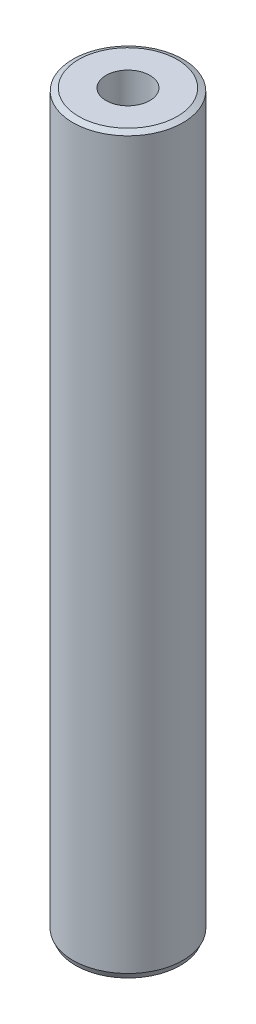
ISO-10303-21;
HEADER;
FILE_DESCRIPTION(('STEP AP214'),'2;1');
FILE_NAME('part.step','',(''),(''),'','','');
FILE_SCHEMA(('AUTOMOTIVE_DESIGN { 1 0 10303 214 1 1 1 1 }'));
ENDSEC;
DATA;
#1=APPLICATION_CONTEXT('core data for automotive mechanical design processes');
#2=APPLICATION_PROTOCOL_DEFINITION('international standard','automotive_design',2000,#1);
#3=PRODUCT_CONTEXT('',#1,'mechanical');
#4=PRODUCT('Part','Part','',(#3));
#5=PRODUCT_RELATED_PRODUCT_CATEGORY('part','',(#4));
#6=PRODUCT_DEFINITION_FORMATION('','',#4);
#7=PRODUCT_DEFINITION_CONTEXT('part definition',#1,'design');
#8=PRODUCT_DEFINITION('design','',#6,#7);
#9=PRODUCT_DEFINITION_SHAPE('','',#8);
#10=(LENGTH_UNIT() NAMED_UNIT(*) SI_UNIT(.MILLI.,.METRE.));
#11=(NAMED_UNIT(*) PLANE_ANGLE_UNIT() SI_UNIT($,.RADIAN.));
#12=(NAMED_UNIT(*) SI_UNIT($,.STERADIAN.) SOLID_ANGLE_UNIT());
#13=UNCERTAINTY_MEASURE_WITH_UNIT(LENGTH_MEASURE(1.E-05),#10,'distance_accuracy_value','');
#14=(GEOMETRIC_REPRESENTATION_CONTEXT(3) GLOBAL_UNCERTAINTY_ASSIGNED_CONTEXT((#13)) GLOBAL_UNIT_ASSIGNED_CONTEXT((#10,
#11,#12)) REPRESENTATION_CONTEXT('',''));
#15=CARTESIAN_POINT('',(0.,0.,0.));
#16=DIRECTION('',(0.,0.,1.));
#17=DIRECTION('',(1.,0.,0.));
#18=AXIS2_PLACEMENT_3D('',#15,#16,#17);
#19=CARTESIAN_POINT('',(0.,600.,0.));
#20=DIRECTION('',(0.,-1.,0.));
#21=DIRECTION('',(0.,0.,-1.));
#22=AXIS2_PLACEMENT_3D('',#19,#20,#21);
#23=CYLINDRICAL_SURFACE('',#22,45.);
#24=CARTESIAN_POINT('',(0.,597.894981040464,0.));
#25=DIRECTION('',(0.,1.,0.));
#26=DIRECTION('',(0.,0.,1.));
#27=AXIS2_PLACEMENT_3D('',#24,#25,#26);
#28=CIRCLE('',#27,45.);
#29=CARTESIAN_POINT('',(0.,597.894981040464,45.));
#30=VERTEX_POINT('',#29);
#31=EDGE_CURVE('E50',#30,#30,#28,.F.);
#32=ORIENTED_EDGE('',*,*,#31,.T.);
#33=EDGE_LOOP('',(#32));
#34=FACE_BOUND('',#33,.T.);
#35=CARTESIAN_POINT('',(0.,4.68177161671279,0.));
#36=DIRECTION('',(0.,1.,0.));
#37=DIRECTION('',(0.,0.,1.));
#38=AXIS2_PLACEMENT_3D('',#35,#36,#37);
#39=CIRCLE('',#38,45.);
#40=CARTESIAN_POINT('',(0.,4.68177161671279,45.));
#41=VERTEX_POINT('',#40);
#42=EDGE_CURVE('E51',#41,#41,#39,.T.);
#43=ORIENTED_EDGE('',*,*,#42,.T.);
#44=EDGE_LOOP('',(#43));
#45=FACE_BOUND('',#44,.T.);
#46=ADVANCED_FACE('F39',(#34,#45),#23,.T.);
#47=CARTESIAN_POINT('',(0.,600.,0.));
#48=DIRECTION('',(0.,1.,0.));
#49=DIRECTION('',(0.,0.,1.));
#50=AXIS2_PLACEMENT_3D('',#47,#48,#49);
#51=PLANE('',#50);
#52=CARTESIAN_POINT('',(0.,600.,0.));
#53=DIRECTION('',(0.,1.,0.));
#54=DIRECTION('',(0.,0.,1.));
#55=AXIS2_PLACEMENT_3D('',#52,#53,#54);
#56=CIRCLE('',#55,40.3182283832877);
#57=CARTESIAN_POINT('',(0.,600.,40.3182283832877));
#58=VERTEX_POINT('',#57);
#59=EDGE_CURVE('E54',#58,#58,#56,.T.);
#60=ORIENTED_EDGE('',*,*,#59,.T.);
#61=EDGE_LOOP('',(#60));
#62=FACE_BOUND('',#61,.T.);
#63=CARTESIAN_POINT('',(0.,600.,0.));
#64=DIRECTION('',(0.,1.,0.));
#65=DIRECTION('',(0.,0.,1.));
#66=AXIS2_PLACEMENT_3D('',#63,#64,#65);
#67=CIRCLE('',#66,17.9281260531012);
#68=CARTESIAN_POINT('',(0.,600.,17.9281260531012));
#69=VERTEX_POINT('',#68);
#70=EDGE_CURVE('E58',#69,#69,#67,.T.);
#71=ORIENTED_EDGE('',*,*,#70,.F.);
#72=EDGE_LOOP('',(#71));
#73=FACE_BOUND('',#72,.T.);
#74=ADVANCED_FACE('F69',(#62,#73),#51,.T.);
#75=CARTESIAN_POINT('',(0.,0.,0.));
#76=DIRECTION('',(0.,1.,0.));
#77=DIRECTION('',(0.,0.,1.));
#78=AXIS2_PLACEMENT_3D('',#75,#76,#77);
#79=PLANE('',#78);
#80=CARTESIAN_POINT('',(0.,0.,0.));
#81=DIRECTION('',(0.,1.,0.));
#82=DIRECTION('',(0.,0.,1.));
#83=AXIS2_PLACEMENT_3D('',#80,#81,#82);
#84=CIRCLE('',#83,42.8949810404639);
#85=CARTESIAN_POINT('',(0.,0.,42.8949810404639));
#86=VERTEX_POINT('',#85);
#87=EDGE_CURVE('E10',#86,#86,#84,.F.);
#88=ORIENTED_EDGE('',*,*,#87,.T.);
#89=EDGE_LOOP('',(#88));
#90=FACE_BOUND('',#89,.T.);
#91=CARTESIAN_POINT('',(0.,0.,0.));
#92=DIRECTION('',(0.,1.,0.));
#93=DIRECTION('',(0.,0.,1.));
#94=AXIS2_PLACEMENT_3D('',#91,#92,#93);
#95=CIRCLE('',#94,17.9281260531012);
#96=CARTESIAN_POINT('',(0.,0.,17.9281260531012));
#97=VERTEX_POINT('',#96);
#98=EDGE_CURVE('E63',#97,#97,#95,.T.);
#99=ORIENTED_EDGE('',*,*,#98,.T.);
#100=EDGE_LOOP('',(#99));
#101=FACE_BOUND('',#100,.T.);
#102=ADVANCED_FACE('F75',(#90,#101),#79,.F.);
#103=CARTESIAN_POINT('',(0.,600.,0.));
#104=DIRECTION('',(0.,-1.,0.));
#105=DIRECTION('',(0.,0.,-1.));
#106=AXIS2_PLACEMENT_3D('',#103,#104,#105);
#107=CYLINDRICAL_SURFACE('',#106,17.9281260531012);
#108=ORIENTED_EDGE('',*,*,#70,.T.);
#109=EDGE_LOOP('',(#108));
#110=FACE_BOUND('',#109,.T.);
#111=ORIENTED_EDGE('',*,*,#98,.F.);
#112=EDGE_LOOP('',(#111));
#113=FACE_BOUND('',#112,.T.);
#114=ADVANCED_FACE('F70',(#110,#113),#107,.F.);
#115=CARTESIAN_POINT('',(0.,600.,0.));
#116=DIRECTION('',(0.,-1.,0.));
#117=DIRECTION('',(0.,0.,-1.));
#118=AXIS2_PLACEMENT_3D('',#115,#116,#117);
#119=CONICAL_SURFACE('',#118,40.3182283832877,1.14825831084162);
#120=ORIENTED_EDGE('',*,*,#31,.F.);
#121=EDGE_LOOP('',(#120));
#122=FACE_BOUND('',#121,.T.);
#123=ORIENTED_EDGE('',*,*,#59,.F.);
#124=EDGE_LOOP('',(#123));
#125=FACE_BOUND('',#124,.T.);
#126=ADVANCED_FACE('F81',(#122,#125),#119,.T.);
#127=CARTESIAN_POINT('',(0.,4.68177161671279,0.));
#128=DIRECTION('',(0.,1.,0.));
#129=DIRECTION('',(0.,0.,1.));
#130=AXIS2_PLACEMENT_3D('',#127,#128,#129);
#131=CONICAL_SURFACE('',#130,45.,0.422538015953285);
#132=ORIENTED_EDGE('',*,*,#87,.F.);
#133=EDGE_LOOP('',(#132));
#134=FACE_BOUND('',#133,.T.);
#135=ORIENTED_EDGE('',*,*,#42,.F.);
#136=EDGE_LOOP('',(#135));
#137=FACE_BOUND('',#136,.T.);
#138=ADVANCED_FACE('F45',(#134,#137),#131,.T.);
#139=CLOSED_SHELL('',(#46,#74,#102,#114,#126,#138));
#140=MANIFOLD_SOLID_BREP('B2',#139);
#141=ADVANCED_BREP_SHAPE_REPRESENTATION('',(#18,#140),#14);
#142=SHAPE_DEFINITION_REPRESENTATION(#9,#141);
ENDSEC;
END-ISO-10303-21;
